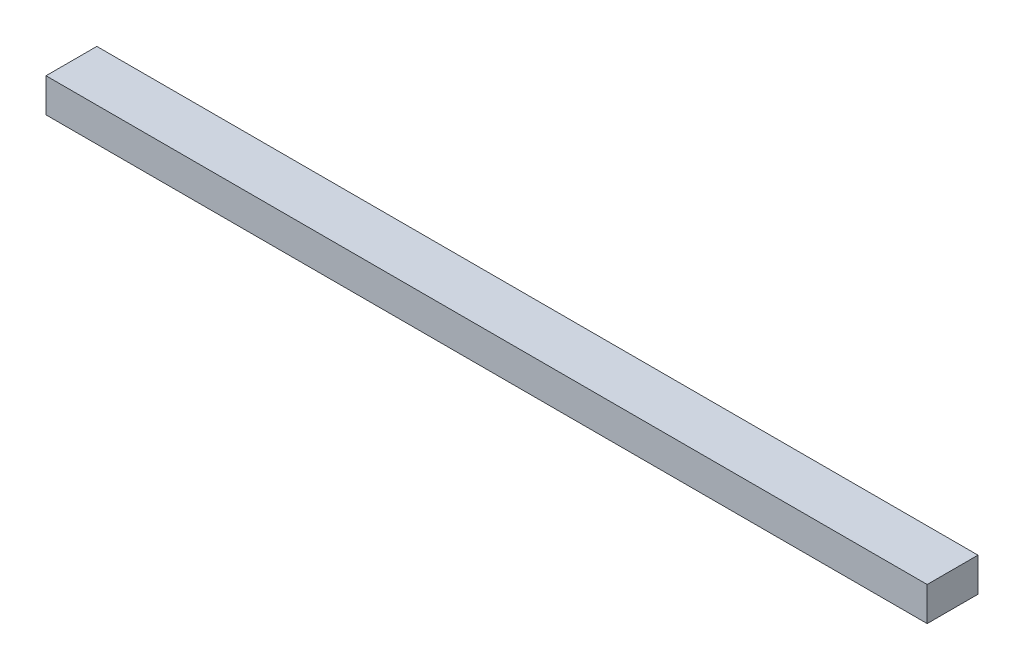
ISO-10303-21;
HEADER;
FILE_DESCRIPTION(('STEP AP214'),'2;1');
FILE_NAME('part.step','',(''),(''),'','','');
FILE_SCHEMA(('AUTOMOTIVE_DESIGN { 1 0 10303 214 1 1 1 1 }'));
ENDSEC;
DATA;
#1=APPLICATION_CONTEXT('core data for automotive mechanical design processes');
#2=APPLICATION_PROTOCOL_DEFINITION('international standard','automotive_design',2000,#1);
#3=PRODUCT_CONTEXT('',#1,'mechanical');
#4=PRODUCT('Part','Part','',(#3));
#5=PRODUCT_RELATED_PRODUCT_CATEGORY('part','',(#4));
#6=PRODUCT_DEFINITION_FORMATION('','',#4);
#7=PRODUCT_DEFINITION_CONTEXT('part definition',#1,'design');
#8=PRODUCT_DEFINITION('design','',#6,#7);
#9=PRODUCT_DEFINITION_SHAPE('','',#8);
#10=(LENGTH_UNIT() NAMED_UNIT(*) SI_UNIT(.MILLI.,.METRE.));
#11=(NAMED_UNIT(*) PLANE_ANGLE_UNIT() SI_UNIT($,.RADIAN.));
#12=(NAMED_UNIT(*) SI_UNIT($,.STERADIAN.) SOLID_ANGLE_UNIT());
#13=UNCERTAINTY_MEASURE_WITH_UNIT(LENGTH_MEASURE(1.E-05),#10,'distance_accuracy_value','');
#14=(GEOMETRIC_REPRESENTATION_CONTEXT(3) GLOBAL_UNCERTAINTY_ASSIGNED_CONTEXT((#13)) GLOBAL_UNIT_ASSIGNED_CONTEXT((#10,
#11,#12)) REPRESENTATION_CONTEXT('',''));
#15=CARTESIAN_POINT('',(0.,0.,0.));
#16=DIRECTION('',(0.,0.,1.));
#17=DIRECTION('',(1.,0.,0.));
#18=AXIS2_PLACEMENT_3D('',#15,#16,#17);
#19=CARTESIAN_POINT('',(0.,2.,0.));
#20=DIRECTION('',(1.,0.,0.));
#21=DIRECTION('',(0.,0.,-1.));
#22=AXIS2_PLACEMENT_3D('',#19,#20,#21);
#23=PLANE('',#22);
#24=DIRECTION('',(0.,0.,1.));
#25=VECTOR('',#24,1.);
#26=CARTESIAN_POINT('',(0.,0.,0.));
#27=LINE('',#26,#25);
#28=CARTESIAN_POINT('',(0.,0.,-3.));
#29=VERTEX_POINT('',#28);
#30=CARTESIAN_POINT('',(0.,0.,0.));
#31=VERTEX_POINT('',#30);
#32=EDGE_CURVE('E102',#29,#31,#27,.T.);
#33=ORIENTED_EDGE('',*,*,#32,.T.);
#34=DIRECTION('',(0.,-1.,0.));
#35=VECTOR('',#34,1.);
#36=CARTESIAN_POINT('',(0.,2.,0.));
#37=LINE('',#36,#35);
#38=CARTESIAN_POINT('',(0.,2.,0.));
#39=VERTEX_POINT('',#38);
#40=EDGE_CURVE('E11',#39,#31,#37,.T.);
#41=ORIENTED_EDGE('',*,*,#40,.F.);
#42=DIRECTION('',(0.,0.,1.));
#43=VECTOR('',#42,1.);
#44=CARTESIAN_POINT('',(0.,2.,0.));
#45=LINE('',#44,#43);
#46=CARTESIAN_POINT('',(0.,2.,-3.));
#47=VERTEX_POINT('',#46);
#48=EDGE_CURVE('E90',#47,#39,#45,.T.);
#49=ORIENTED_EDGE('',*,*,#48,.F.);
#50=DIRECTION('',(0.,-1.,0.));
#51=VECTOR('',#50,1.);
#52=CARTESIAN_POINT('',(0.,2.,-3.));
#53=LINE('',#52,#51);
#54=EDGE_CURVE('E98',#47,#29,#53,.T.);
#55=ORIENTED_EDGE('',*,*,#54,.T.);
#56=EDGE_LOOP('',(#33,#41,#49,#55));
#57=FACE_BOUND('',#56,.T.);
#58=ADVANCED_FACE('F39',(#57),#23,.F.);
#59=CARTESIAN_POINT('',(0.,2.,0.));
#60=DIRECTION('',(0.,0.,-1.));
#61=DIRECTION('',(-1.,0.,0.));
#62=AXIS2_PLACEMENT_3D('',#59,#60,#61);
#63=PLANE('',#62);
#64=DIRECTION('',(1.,0.,0.));
#65=VECTOR('',#64,1.);
#66=CARTESIAN_POINT('',(0.,0.,0.));
#67=LINE('',#66,#65);
#68=CARTESIAN_POINT('',(52.,0.,0.));
#69=VERTEX_POINT('',#68);
#70=EDGE_CURVE('E94',#31,#69,#67,.T.);
#71=ORIENTED_EDGE('',*,*,#70,.T.);
#72=DIRECTION('',(0.,-1.,0.));
#73=VECTOR('',#72,1.);
#74=CARTESIAN_POINT('',(52.,2.,0.));
#75=LINE('',#74,#73);
#76=CARTESIAN_POINT('',(52.,2.,0.));
#77=VERTEX_POINT('',#76);
#78=EDGE_CURVE('E47',#77,#69,#75,.T.);
#79=ORIENTED_EDGE('',*,*,#78,.F.);
#80=DIRECTION('',(1.,0.,0.));
#81=VECTOR('',#80,1.);
#82=CARTESIAN_POINT('',(0.,2.,0.));
#83=LINE('',#82,#81);
#84=EDGE_CURVE('E85',#39,#77,#83,.T.);
#85=ORIENTED_EDGE('',*,*,#84,.F.);
#86=ORIENTED_EDGE('',*,*,#40,.T.);
#87=EDGE_LOOP('',(#71,#79,#85,#86));
#88=FACE_BOUND('',#87,.T.);
#89=ADVANCED_FACE('F93',(#88),#63,.F.);
#90=CARTESIAN_POINT('',(52.,2.,0.));
#91=DIRECTION('',(-1.,0.,0.));
#92=DIRECTION('',(0.,0.,1.));
#93=AXIS2_PLACEMENT_3D('',#90,#91,#92);
#94=PLANE('',#93);
#95=DIRECTION('',(0.,0.,-1.));
#96=VECTOR('',#95,1.);
#97=CARTESIAN_POINT('',(52.,0.,0.));
#98=LINE('',#97,#96);
#99=CARTESIAN_POINT('',(52.,0.,-3.));
#100=VERTEX_POINT('',#99);
#101=EDGE_CURVE('E72',#69,#100,#98,.T.);
#102=ORIENTED_EDGE('',*,*,#101,.T.);
#103=DIRECTION('',(0.,-1.,0.));
#104=VECTOR('',#103,1.);
#105=CARTESIAN_POINT('',(52.,2.,-3.));
#106=LINE('',#105,#104);
#107=CARTESIAN_POINT('',(52.,2.,-3.));
#108=VERTEX_POINT('',#107);
#109=EDGE_CURVE('E95',#108,#100,#106,.T.);
#110=ORIENTED_EDGE('',*,*,#109,.F.);
#111=DIRECTION('',(0.,0.,-1.));
#112=VECTOR('',#111,1.);
#113=CARTESIAN_POINT('',(52.,2.,0.));
#114=LINE('',#113,#112);
#115=EDGE_CURVE('E88',#77,#108,#114,.T.);
#116=ORIENTED_EDGE('',*,*,#115,.F.);
#117=ORIENTED_EDGE('',*,*,#78,.T.);
#118=EDGE_LOOP('',(#102,#110,#116,#117));
#119=FACE_BOUND('',#118,.T.);
#120=ADVANCED_FACE('F96',(#119),#94,.F.);
#121=CARTESIAN_POINT('',(0.,2.,-3.));
#122=DIRECTION('',(0.,0.,1.));
#123=DIRECTION('',(1.,0.,0.));
#124=AXIS2_PLACEMENT_3D('',#121,#122,#123);
#125=PLANE('',#124);
#126=DIRECTION('',(-1.,0.,0.));
#127=VECTOR('',#126,1.);
#128=CARTESIAN_POINT('',(0.,0.,-3.));
#129=LINE('',#128,#127);
#130=EDGE_CURVE('E78',#100,#29,#129,.T.);
#131=ORIENTED_EDGE('',*,*,#130,.T.);
#132=ORIENTED_EDGE('',*,*,#54,.F.);
#133=DIRECTION('',(-1.,0.,0.));
#134=VECTOR('',#133,1.);
#135=CARTESIAN_POINT('',(0.,2.,-3.));
#136=LINE('',#135,#134);
#137=EDGE_CURVE('E55',#108,#47,#136,.T.);
#138=ORIENTED_EDGE('',*,*,#137,.F.);
#139=ORIENTED_EDGE('',*,*,#109,.T.);
#140=EDGE_LOOP('',(#131,#132,#138,#139));
#141=FACE_BOUND('',#140,.T.);
#142=ADVANCED_FACE('F109',(#141),#125,.F.);
#143=CARTESIAN_POINT('',(0.,2.,0.));
#144=DIRECTION('',(0.,-1.,0.));
#145=DIRECTION('',(0.,0.,-1.));
#146=AXIS2_PLACEMENT_3D('',#143,#144,#145);
#147=PLANE('',#146);
#148=ORIENTED_EDGE('',*,*,#48,.T.);
#149=ORIENTED_EDGE('',*,*,#84,.T.);
#150=ORIENTED_EDGE('',*,*,#115,.T.);
#151=ORIENTED_EDGE('',*,*,#137,.T.);
#152=EDGE_LOOP('',(#148,#149,#150,#151));
#153=FACE_BOUND('',#152,.T.);
#154=ADVANCED_FACE('F86',(#153),#147,.F.);
#155=CARTESIAN_POINT('',(0.,0.,0.));
#156=DIRECTION('',(0.,-1.,0.));
#157=DIRECTION('',(0.,0.,-1.));
#158=AXIS2_PLACEMENT_3D('',#155,#156,#157);
#159=PLANE('',#158);
#160=ORIENTED_EDGE('',*,*,#32,.F.);
#161=ORIENTED_EDGE('',*,*,#130,.F.);
#162=ORIENTED_EDGE('',*,*,#101,.F.);
#163=ORIENTED_EDGE('',*,*,#70,.F.);
#164=EDGE_LOOP('',(#160,#161,#162,#163));
#165=FACE_BOUND('',#164,.T.);
#166=ADVANCED_FACE('F112',(#165),#159,.T.);
#167=CLOSED_SHELL('',(#58,#89,#120,#142,#154,#166));
#168=MANIFOLD_SOLID_BREP('B2',#167);
#169=ADVANCED_BREP_SHAPE_REPRESENTATION('',(#18,#168),#14);
#170=SHAPE_DEFINITION_REPRESENTATION(#9,#169);
ENDSEC;
END-ISO-10303-21;
